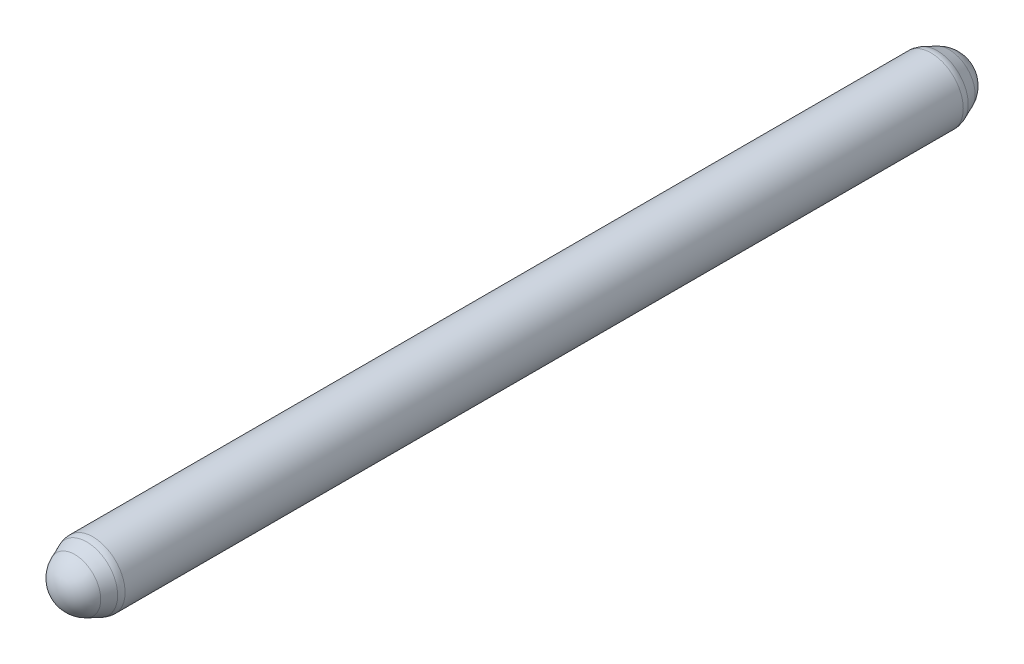
ISO-10303-21;
HEADER;
FILE_DESCRIPTION(('STEP AP214'),'2;1');
FILE_NAME('part.step','',(''),(''),'','','');
FILE_SCHEMA(('AUTOMOTIVE_DESIGN { 1 0 10303 214 1 1 1 1 }'));
ENDSEC;
DATA;
#1=APPLICATION_CONTEXT('core data for automotive mechanical design processes');
#2=APPLICATION_PROTOCOL_DEFINITION('international standard','automotive_design',2000,#1);
#3=PRODUCT_CONTEXT('',#1,'mechanical');
#4=PRODUCT('Part','Part','',(#3));
#5=PRODUCT_RELATED_PRODUCT_CATEGORY('part','',(#4));
#6=PRODUCT_DEFINITION_FORMATION('','',#4);
#7=PRODUCT_DEFINITION_CONTEXT('part definition',#1,'design');
#8=PRODUCT_DEFINITION('design','',#6,#7);
#9=PRODUCT_DEFINITION_SHAPE('','',#8);
#10=(LENGTH_UNIT() NAMED_UNIT(*) SI_UNIT(.MILLI.,.METRE.));
#11=(NAMED_UNIT(*) PLANE_ANGLE_UNIT() SI_UNIT($,.RADIAN.));
#12=(NAMED_UNIT(*) SI_UNIT($,.STERADIAN.) SOLID_ANGLE_UNIT());
#13=UNCERTAINTY_MEASURE_WITH_UNIT(LENGTH_MEASURE(1.E-05),#10,'distance_accuracy_value','');
#14=(GEOMETRIC_REPRESENTATION_CONTEXT(3) GLOBAL_UNCERTAINTY_ASSIGNED_CONTEXT((#13)) GLOBAL_UNIT_ASSIGNED_CONTEXT((#10,
#11,#12)) REPRESENTATION_CONTEXT('',''));
#15=CARTESIAN_POINT('',(0.,0.,0.));
#16=DIRECTION('',(0.,0.,1.));
#17=DIRECTION('',(1.,0.,0.));
#18=AXIS2_PLACEMENT_3D('',#15,#16,#17);
#19=CARTESIAN_POINT('',(0.,0.,262.5));
#20=DIRECTION('',(0.,0.,-1.));
#21=DIRECTION('',(-1.,0.,0.));
#22=AXIS2_PLACEMENT_3D('',#19,#20,#21);
#23=CYLINDRICAL_SURFACE('',#22,20.);
#24=CARTESIAN_POINT('',(0.,0.,260.493450400581));
#25=DIRECTION('',(0.,0.,-1.));
#26=DIRECTION('',(0.,1.,0.));
#27=AXIS2_PLACEMENT_3D('',#24,#25,#26);
#28=CIRCLE('',#27,20.);
#29=CARTESIAN_POINT('',(0.,20.,260.493450400581));
#30=VERTEX_POINT('',#29);
#31=EDGE_CURVE('E42',#30,#30,#28,.T.);
#32=ORIENTED_EDGE('',*,*,#31,.T.);
#33=EDGE_LOOP('',(#32));
#34=FACE_BOUND('',#33,.T.);
#35=CARTESIAN_POINT('',(0.,0.,-260.493450400581));
#36=DIRECTION('',(0.,0.,1.));
#37=DIRECTION('',(0.,-1.,0.));
#38=AXIS2_PLACEMENT_3D('',#35,#36,#37);
#39=CIRCLE('',#38,20.);
#40=CARTESIAN_POINT('',(0.,-20.,-260.493450400581));
#41=VERTEX_POINT('',#40);
#42=EDGE_CURVE('E46',#41,#41,#39,.T.);
#43=ORIENTED_EDGE('',*,*,#42,.T.);
#44=EDGE_LOOP('',(#43));
#45=FACE_BOUND('',#44,.T.);
#46=ADVANCED_FACE('F35',(#34,#45),#23,.T.);
#47=CARTESIAN_POINT('',(0.,0.,262.5));
#48=DIRECTION('',(0.,0.,-1.));
#49=DIRECTION('',(0.,1.,0.));
#50=AXIS2_PLACEMENT_3D('',#47,#48,#49);
#51=CONICAL_SURFACE('',#50,20.,0.396050499259407);
#52=CARTESIAN_POINT('',(0.,0.,264.35122623568));
#53=DIRECTION('',(0.,0.,-1.));
#54=DIRECTION('',(0.,1.,0.));
#55=AXIS2_PLACEMENT_3D('',#52,#53,#54);
#56=CIRCLE('',#55,19.2259181443433);
#57=CARTESIAN_POINT('',(0.,19.2259181443433,264.35122623568));
#58=VERTEX_POINT('',#57);
#59=EDGE_CURVE('E50',#58,#58,#56,.F.);
#60=ORIENTED_EDGE('',*,*,#59,.T.);
#61=EDGE_LOOP('',(#60));
#62=FACE_BOUND('',#61,.T.);
#63=CARTESIAN_POINT('',(0.,0.,271.763715381512));
#64=DIRECTION('',(0.,0.,-1.));
#65=DIRECTION('',(0.,1.,0.));
#66=AXIS2_PLACEMENT_3D('',#63,#64,#65);
#67=CIRCLE('',#66,16.1264194215783);
#68=CARTESIAN_POINT('',(0.,16.1264194215783,271.763715381512));
#69=VERTEX_POINT('',#68);
#70=EDGE_CURVE('E55',#69,#69,#67,.T.);
#71=ORIENTED_EDGE('',*,*,#70,.T.);
#72=EDGE_LOOP('',(#71));
#73=FACE_BOUND('',#72,.T.);
#74=ADVANCED_FACE('F74',(#62,#73),#51,.T.);
#75=CARTESIAN_POINT('',(0.,0.,265.02052622918));
#76=DIRECTION('',(0.,0.,-1.));
#77=DIRECTION('',(0.,1.,0.));
#78=AXIS2_PLACEMENT_3D('',#75,#76,#77);
#79=SPHERICAL_SURFACE('',#78,17.4794737708202);
#80=ORIENTED_EDGE('',*,*,#70,.F.);
#81=EDGE_LOOP('',(#80));
#82=FACE_BOUND('',#81,.T.);
#83=ADVANCED_FACE('F66',(#82),#79,.T.);
#84=CARTESIAN_POINT('',(0.,0.,-262.5));
#85=DIRECTION('',(0.,0.,1.));
#86=DIRECTION('',(0.,1.,0.));
#87=AXIS2_PLACEMENT_3D('',#84,#85,#86);
#88=CONICAL_SURFACE('',#87,20.,0.396050499259407);
#89=CARTESIAN_POINT('',(0.,0.,-264.351226235681));
#90=DIRECTION('',(0.,0.,1.));
#91=DIRECTION('',(0.,-1.,0.));
#92=AXIS2_PLACEMENT_3D('',#89,#90,#91);
#93=CIRCLE('',#92,19.2259181443433);
#94=CARTESIAN_POINT('',(0.,-19.2259181443433,-264.351226235681));
#95=VERTEX_POINT('',#94);
#96=EDGE_CURVE('E10',#95,#95,#93,.F.);
#97=ORIENTED_EDGE('',*,*,#96,.T.);
#98=EDGE_LOOP('',(#97));
#99=FACE_BOUND('',#98,.T.);
#100=CARTESIAN_POINT('',(0.,0.,-271.763715381512));
#101=DIRECTION('',(0.,0.,-1.));
#102=DIRECTION('',(0.,1.,0.));
#103=AXIS2_PLACEMENT_3D('',#100,#101,#102);
#104=CIRCLE('',#103,16.1264194215783);
#105=CARTESIAN_POINT('',(0.,16.1264194215783,-271.763715381512));
#106=VERTEX_POINT('',#105);
#107=EDGE_CURVE('E58',#106,#106,#104,.T.);
#108=ORIENTED_EDGE('',*,*,#107,.F.);
#109=EDGE_LOOP('',(#108));
#110=FACE_BOUND('',#109,.T.);
#111=ADVANCED_FACE('F64',(#99,#110),#88,.T.);
#112=CARTESIAN_POINT('',(0.,0.,-265.02052622918));
#113=DIRECTION('',(0.,0.,1.));
#114=DIRECTION('',(0.,1.,0.));
#115=AXIS2_PLACEMENT_3D('',#112,#113,#114);
#116=SPHERICAL_SURFACE('',#115,17.4794737708202);
#117=ORIENTED_EDGE('',*,*,#107,.T.);
#118=EDGE_LOOP('',(#117));
#119=FACE_BOUND('',#118,.T.);
#120=ADVANCED_FACE('F62',(#119),#116,.T.);
#121=CARTESIAN_POINT('',(0.,0.,260.493450400581));
#122=DIRECTION('',(0.,0.,-1.));
#123=DIRECTION('',(0.,1.,0.));
#124=AXIS2_PLACEMENT_3D('',#121,#122,#123);
#125=DEGENERATE_TOROIDAL_SURFACE('',#124,10.,10.,.T.);
#126=ORIENTED_EDGE('',*,*,#31,.F.);
#127=EDGE_LOOP('',(#126));
#128=FACE_BOUND('',#127,.T.);
#129=ORIENTED_EDGE('',*,*,#59,.F.);
#130=EDGE_LOOP('',(#129));
#131=FACE_BOUND('',#130,.T.);
#132=ADVANCED_FACE('F72',(#128,#131),#125,.T.);
#133=CARTESIAN_POINT('',(0.,0.,-260.493450400581));
#134=DIRECTION('',(0.,0.,1.));
#135=DIRECTION('',(0.,-1.,0.));
#136=AXIS2_PLACEMENT_3D('',#133,#134,#135);
#137=DEGENERATE_TOROIDAL_SURFACE('',#136,9.99999999999995,10.,.T.);
#138=ORIENTED_EDGE('',*,*,#42,.F.);
#139=EDGE_LOOP('',(#138));
#140=FACE_BOUND('',#139,.T.);
#141=ORIENTED_EDGE('',*,*,#96,.F.);
#142=EDGE_LOOP('',(#141));
#143=FACE_BOUND('',#142,.T.);
#144=ADVANCED_FACE('F37',(#140,#143),#137,.T.);
#145=CLOSED_SHELL('',(#46,#74,#83,#111,#120,#132,#144));
#146=MANIFOLD_SOLID_BREP('B2',#145);
#147=ADVANCED_BREP_SHAPE_REPRESENTATION('',(#18,#146),#14);
#148=SHAPE_DEFINITION_REPRESENTATION(#9,#147);
ENDSEC;
END-ISO-10303-21;
